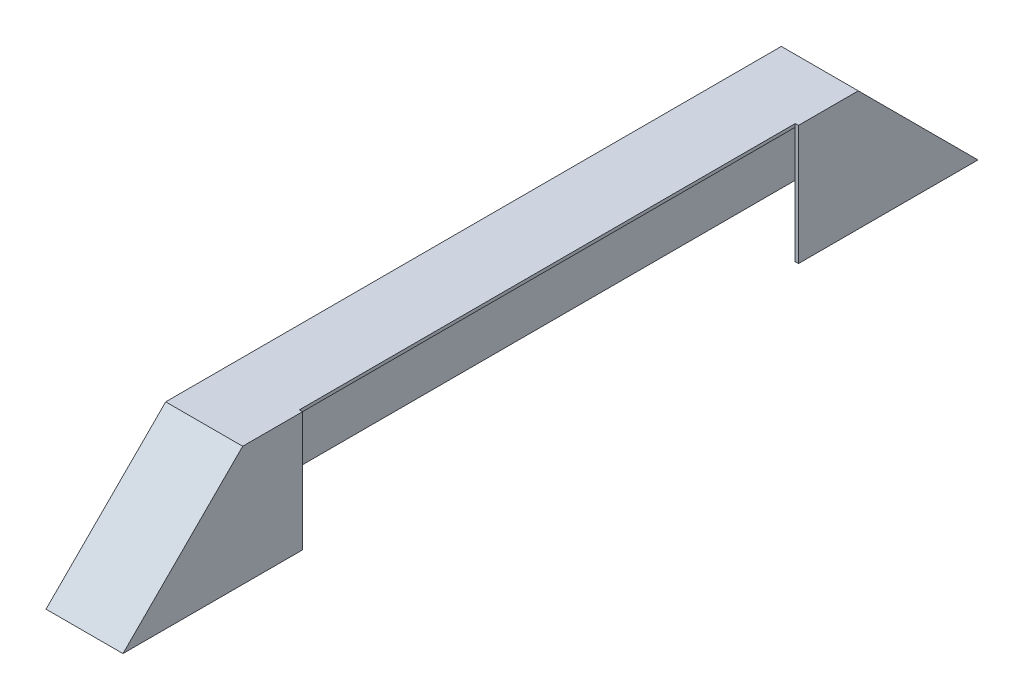
ISO-10303-21;
HEADER;
FILE_DESCRIPTION(('STEP AP214'),'2;1');
FILE_NAME('part.step','',(''),(''),'','','');
FILE_SCHEMA(('AUTOMOTIVE_DESIGN { 1 0 10303 214 1 1 1 1 }'));
ENDSEC;
DATA;
#1=APPLICATION_CONTEXT('core data for automotive mechanical design processes');
#2=APPLICATION_PROTOCOL_DEFINITION('international standard','automotive_design',2000,#1);
#3=PRODUCT_CONTEXT('',#1,'mechanical');
#4=PRODUCT('Part','Part','',(#3));
#5=PRODUCT_RELATED_PRODUCT_CATEGORY('part','',(#4));
#6=PRODUCT_DEFINITION_FORMATION('','',#4);
#7=PRODUCT_DEFINITION_CONTEXT('part definition',#1,'design');
#8=PRODUCT_DEFINITION('design','',#6,#7);
#9=PRODUCT_DEFINITION_SHAPE('','',#8);
#10=(LENGTH_UNIT() NAMED_UNIT(*) SI_UNIT(.MILLI.,.METRE.));
#11=(NAMED_UNIT(*) PLANE_ANGLE_UNIT() SI_UNIT($,.RADIAN.));
#12=(NAMED_UNIT(*) SI_UNIT($,.STERADIAN.) SOLID_ANGLE_UNIT());
#13=UNCERTAINTY_MEASURE_WITH_UNIT(LENGTH_MEASURE(1.E-05),#10,'distance_accuracy_value','');
#14=(GEOMETRIC_REPRESENTATION_CONTEXT(3) GLOBAL_UNCERTAINTY_ASSIGNED_CONTEXT((#13)) GLOBAL_UNIT_ASSIGNED_CONTEXT((#10,
#11,#12)) REPRESENTATION_CONTEXT('',''));
#15=CARTESIAN_POINT('',(0.,0.,0.));
#16=DIRECTION('',(0.,0.,1.));
#17=DIRECTION('',(1.,0.,0.));
#18=AXIS2_PLACEMENT_3D('',#15,#16,#17);
#19=CARTESIAN_POINT('',(114.3,0.,0.));
#20=DIRECTION('',(-1.,0.,0.));
#21=DIRECTION('',(0.,0.,1.));
#22=AXIS2_PLACEMENT_3D('',#19,#20,#21);
#23=PLANE('',#22);
#24=DIRECTION('',(0.,0.,-1.));
#25=VECTOR('',#24,1.);
#26=CARTESIAN_POINT('',(114.3,-88.9,634.999999999997));
#27=LINE('',#26,#25);
#28=CARTESIAN_POINT('',(114.3,-88.9,634.999999999997));
#29=VERTEX_POINT('',#28);
#30=CARTESIAN_POINT('',(114.3,-88.9,368.3));
#31=VERTEX_POINT('',#30);
#32=EDGE_CURVE('E200',#29,#31,#27,.T.);
#33=ORIENTED_EDGE('',*,*,#32,.T.);
#34=DIRECTION('',(0.,-1.,0.));
#35=VECTOR('',#34,1.);
#36=CARTESIAN_POINT('',(114.3,-88.9,368.3));
#37=LINE('',#36,#35);
#38=CARTESIAN_POINT('',(114.3,88.9,368.3));
#39=VERTEX_POINT('',#38);
#40=EDGE_CURVE('E143',#39,#31,#37,.T.);
#41=ORIENTED_EDGE('',*,*,#40,.F.);
#42=DIRECTION('',(0.,0.,1.));
#43=VECTOR('',#42,1.);
#44=CARTESIAN_POINT('',(114.3,88.9,457.2));
#45=LINE('',#44,#43);
#46=CARTESIAN_POINT('',(114.3,88.9,457.2));
#47=VERTEX_POINT('',#46);
#48=EDGE_CURVE('E148',#39,#47,#45,.T.);
#49=ORIENTED_EDGE('',*,*,#48,.T.);
#50=DIRECTION('',(0.,-0.707106781186554,0.707106781186541));
#51=VECTOR('',#50,1.);
#52=CARTESIAN_POINT('',(114.3,88.9,457.2));
#53=LINE('',#52,#51);
#54=EDGE_CURVE('E197',#47,#29,#53,.T.);
#55=ORIENTED_EDGE('',*,*,#54,.T.);
#56=EDGE_LOOP('',(#33,#41,#49,#55));
#57=FACE_BOUND('',#56,.T.);
#58=ADVANCED_FACE('F33',(#57),#23,.F.);
#59=CARTESIAN_POINT('',(109.5375,0.,0.));
#60=DIRECTION('',(-1.,0.,0.));
#61=DIRECTION('',(0.,0.,1.));
#62=AXIS2_PLACEMENT_3D('',#59,#60,#61);
#63=PLANE('',#62);
#64=DIRECTION('',(0.,1.,0.));
#65=VECTOR('',#64,1.);
#66=CARTESIAN_POINT('',(109.5375,0.,368.3));
#67=LINE('',#66,#65);
#68=CARTESIAN_POINT('',(109.5375,-88.9,368.3));
#69=VERTEX_POINT('',#68);
#70=CARTESIAN_POINT('',(109.5375,84.1375,368.3));
#71=VERTEX_POINT('',#70);
#72=EDGE_CURVE('E11',#69,#71,#67,.T.);
#73=ORIENTED_EDGE('',*,*,#72,.F.);
#74=DIRECTION('',(0.,0.,-1.));
#75=VECTOR('',#74,1.);
#76=CARTESIAN_POINT('',(109.5375,-88.9,0.));
#77=LINE('',#76,#75);
#78=CARTESIAN_POINT('',(109.5375,-88.9,628.264807909195));
#79=VERTEX_POINT('',#78);
#80=EDGE_CURVE('E56',#79,#69,#77,.T.);
#81=ORIENTED_EDGE('',*,*,#80,.F.);
#82=DIRECTION('',(0.,-0.707106781186554,0.707106781186541));
#83=VECTOR('',#82,1.);
#84=CARTESIAN_POINT('',(109.5375,269.682403954598,269.682403954603));
#85=LINE('',#84,#83);
#86=CARTESIAN_POINT('',(109.5375,84.1375,455.227307909198));
#87=VERTEX_POINT('',#86);
#88=EDGE_CURVE('E178',#87,#79,#85,.T.);
#89=ORIENTED_EDGE('',*,*,#88,.F.);
#90=DIRECTION('',(0.,0.,1.));
#91=VECTOR('',#90,1.);
#92=CARTESIAN_POINT('',(109.5375,84.1375,0.));
#93=LINE('',#92,#91);
#94=EDGE_CURVE('E168',#71,#87,#93,.T.);
#95=ORIENTED_EDGE('',*,*,#94,.F.);
#96=EDGE_LOOP('',(#73,#81,#89,#95));
#97=FACE_BOUND('',#96,.T.);
#98=ADVANCED_FACE('F261',(#97),#63,.T.);
#99=CARTESIAN_POINT('',(114.3,-88.9,-457.2));
#100=DIRECTION('',(0.,1.,0.));
#101=DIRECTION('',(0.,0.,1.));
#102=AXIS2_PLACEMENT_3D('',#99,#100,#101);
#103=PLANE('',#102);
#104=ORIENTED_EDGE('',*,*,#80,.T.);
#105=DIRECTION('',(1.,0.,0.));
#106=VECTOR('',#105,1.);
#107=CARTESIAN_POINT('',(-648.217341620956,-88.9,368.3));
#108=LINE('',#107,#106);
#109=EDGE_CURVE('E136',#69,#31,#108,.T.);
#110=ORIENTED_EDGE('',*,*,#109,.T.);
#111=ORIENTED_EDGE('',*,*,#32,.F.);
#112=DIRECTION('',(-1.,0.,0.));
#113=VECTOR('',#112,1.);
#114=CARTESIAN_POINT('',(114.3,-88.9,634.999999999997));
#115=LINE('',#114,#113);
#116=CARTESIAN_POINT('',(0.,-88.9,634.999999999997));
#117=VERTEX_POINT('',#116);
#118=EDGE_CURVE('E214',#29,#117,#115,.T.);
#119=ORIENTED_EDGE('',*,*,#118,.T.);
#120=DIRECTION('',(0.,0.,-1.));
#121=VECTOR('',#120,1.);
#122=CARTESIAN_POINT('',(0.,-88.9,-457.2));
#123=LINE('',#122,#121);
#124=CARTESIAN_POINT('',(0.,-88.9,-635.000000000003));
#125=VERTEX_POINT('',#124);
#126=EDGE_CURVE('E193',#117,#125,#123,.T.);
#127=ORIENTED_EDGE('',*,*,#126,.T.);
#128=DIRECTION('',(-1.,0.,0.));
#129=VECTOR('',#128,1.);
#130=CARTESIAN_POINT('',(114.3,-88.9,-635.000000000003));
#131=LINE('',#130,#129);
#132=CARTESIAN_POINT('',(114.3,-88.9,-635.000000000003));
#133=VERTEX_POINT('',#132);
#134=EDGE_CURVE('E203',#133,#125,#131,.T.);
#135=ORIENTED_EDGE('',*,*,#134,.F.);
#136=CARTESIAN_POINT('',(114.3,-88.9,-368.3));
#137=VERTEX_POINT('',#136);
#138=EDGE_CURVE('E199',#137,#133,#27,.T.);
#139=ORIENTED_EDGE('',*,*,#138,.F.);
#140=DIRECTION('',(1.,0.,0.));
#141=VECTOR('',#140,1.);
#142=CARTESIAN_POINT('',(-648.217341620956,-88.9,-368.3));
#143=LINE('',#142,#141);
#144=CARTESIAN_POINT('',(109.5375,-88.9,-368.3));
#145=VERTEX_POINT('',#144);
#146=EDGE_CURVE('E242',#145,#137,#143,.T.);
#147=ORIENTED_EDGE('',*,*,#146,.F.);
#148=CARTESIAN_POINT('',(109.5375,-88.9,-628.264807909201));
#149=VERTEX_POINT('',#148);
#150=EDGE_CURVE('E182',#145,#149,#77,.T.);
#151=ORIENTED_EDGE('',*,*,#150,.T.);
#152=DIRECTION('',(-1.,0.,0.));
#153=VECTOR('',#152,1.);
#154=CARTESIAN_POINT('',(114.3,-88.9,-628.264807909201));
#155=LINE('',#154,#153);
#156=CARTESIAN_POINT('',(4.7625,-88.9,-628.264807909201));
#157=VERTEX_POINT('',#156);
#158=EDGE_CURVE('E183',#149,#157,#155,.T.);
#159=ORIENTED_EDGE('',*,*,#158,.T.);
#160=DIRECTION('',(0.,0.,-1.));
#161=VECTOR('',#160,1.);
#162=CARTESIAN_POINT('',(4.7625,-88.9,0.));
#163=LINE('',#162,#161);
#164=CARTESIAN_POINT('',(4.7625,-88.9,628.264807909195));
#165=VERTEX_POINT('',#164);
#166=EDGE_CURVE('E169',#165,#157,#163,.T.);
#167=ORIENTED_EDGE('',*,*,#166,.F.);
#168=DIRECTION('',(-1.,0.,0.));
#169=VECTOR('',#168,1.);
#170=CARTESIAN_POINT('',(114.3,-88.9,628.264807909195));
#171=LINE('',#170,#169);
#172=EDGE_CURVE('E174',#79,#165,#171,.T.);
#173=ORIENTED_EDGE('',*,*,#172,.F.);
#174=EDGE_LOOP('',(#104,#110,#111,#119,#127,#135,#139,#147,#151,#159,#167,#173));
#175=FACE_BOUND('',#174,.T.);
#176=ADVANCED_FACE('F234',(#175),#103,.F.);
#177=CARTESIAN_POINT('',(114.3,88.9,-457.2));
#178=DIRECTION('',(0.,-0.707106781186554,0.707106781186541));
#179=DIRECTION('',(0.,-0.707106781186541,-0.707106781186554));
#180=AXIS2_PLACEMENT_3D('',#177,#178,#179);
#181=PLANE('',#180);
#182=DIRECTION('',(0.,0.707106781186541,0.707106781186554));
#183=VECTOR('',#182,1.);
#184=CARTESIAN_POINT('',(0.,88.9,-457.2));
#185=LINE('',#184,#183);
#186=CARTESIAN_POINT('',(0.,88.9,-457.2));
#187=VERTEX_POINT('',#186);
#188=EDGE_CURVE('E163',#125,#187,#185,.T.);
#189=ORIENTED_EDGE('',*,*,#188,.T.);
#190=DIRECTION('',(-1.,0.,0.));
#191=VECTOR('',#190,1.);
#192=CARTESIAN_POINT('',(114.3,88.9,-457.2));
#193=LINE('',#192,#191);
#194=CARTESIAN_POINT('',(114.3,88.9,-457.2));
#195=VERTEX_POINT('',#194);
#196=EDGE_CURVE('E41',#195,#187,#193,.T.);
#197=ORIENTED_EDGE('',*,*,#196,.F.);
#198=DIRECTION('',(0.,0.707106781186541,0.707106781186554));
#199=VECTOR('',#198,1.);
#200=CARTESIAN_POINT('',(114.3,88.9,-457.2));
#201=LINE('',#200,#199);
#202=EDGE_CURVE('E190',#133,#195,#201,.T.);
#203=ORIENTED_EDGE('',*,*,#202,.F.);
#204=ORIENTED_EDGE('',*,*,#134,.T.);
#205=EDGE_LOOP('',(#189,#197,#203,#204));
#206=FACE_BOUND('',#205,.T.);
#207=ADVANCED_FACE('F35',(#206),#181,.F.);
#208=CARTESIAN_POINT('',(114.3,88.9,457.2));
#209=DIRECTION('',(0.,-1.,0.));
#210=DIRECTION('',(0.,0.,-1.));
#211=AXIS2_PLACEMENT_3D('',#208,#209,#210);
#212=PLANE('',#211);
#213=ORIENTED_EDGE('',*,*,#48,.F.);
#214=DIRECTION('',(1.,0.,0.));
#215=VECTOR('',#214,1.);
#216=CARTESIAN_POINT('',(-648.217341620956,88.9,368.3));
#217=LINE('',#216,#215);
#218=CARTESIAN_POINT('',(109.5375,88.9,368.3));
#219=VERTEX_POINT('',#218);
#220=EDGE_CURVE('E132',#219,#39,#217,.T.);
#221=ORIENTED_EDGE('',*,*,#220,.F.);
#222=DIRECTION('',(0.,0.,1.));
#223=VECTOR('',#222,1.);
#224=CARTESIAN_POINT('',(109.5375,88.9,368.3));
#225=LINE('',#224,#223);
#226=CARTESIAN_POINT('',(109.5375,88.9,-368.3));
#227=VERTEX_POINT('',#226);
#228=EDGE_CURVE('E139',#227,#219,#225,.T.);
#229=ORIENTED_EDGE('',*,*,#228,.F.);
#230=DIRECTION('',(1.,0.,0.));
#231=VECTOR('',#230,1.);
#232=CARTESIAN_POINT('',(-648.217341620956,88.9,-368.3));
#233=LINE('',#232,#231);
#234=CARTESIAN_POINT('',(114.3,88.9,-368.3));
#235=VERTEX_POINT('',#234);
#236=EDGE_CURVE('E153',#227,#235,#233,.T.);
#237=ORIENTED_EDGE('',*,*,#236,.T.);
#238=EDGE_CURVE('E194',#195,#235,#45,.T.);
#239=ORIENTED_EDGE('',*,*,#238,.F.);
#240=ORIENTED_EDGE('',*,*,#196,.T.);
#241=DIRECTION('',(0.,0.,1.));
#242=VECTOR('',#241,1.);
#243=CARTESIAN_POINT('',(0.,88.9,457.2));
#244=LINE('',#243,#242);
#245=CARTESIAN_POINT('',(0.,88.9,457.2));
#246=VERTEX_POINT('',#245);
#247=EDGE_CURVE('E206',#187,#246,#244,.T.);
#248=ORIENTED_EDGE('',*,*,#247,.T.);
#249=DIRECTION('',(-1.,0.,0.));
#250=VECTOR('',#249,1.);
#251=CARTESIAN_POINT('',(114.3,88.9,457.2));
#252=LINE('',#251,#250);
#253=EDGE_CURVE('E217',#47,#246,#252,.T.);
#254=ORIENTED_EDGE('',*,*,#253,.F.);
#255=EDGE_LOOP('',(#213,#221,#229,#237,#239,#240,#248,#254));
#256=FACE_BOUND('',#255,.T.);
#257=ADVANCED_FACE('F146',(#256),#212,.F.);
#258=CARTESIAN_POINT('',(114.3,88.9,457.2));
#259=DIRECTION('',(0.,-0.707106781186541,-0.707106781186554));
#260=DIRECTION('',(0.,0.707106781186554,-0.707106781186541));
#261=AXIS2_PLACEMENT_3D('',#258,#259,#260);
#262=PLANE('',#261);
#263=DIRECTION('',(0.,-0.707106781186554,0.707106781186541));
#264=VECTOR('',#263,1.);
#265=CARTESIAN_POINT('',(0.,88.9,457.2));
#266=LINE('',#265,#264);
#267=EDGE_CURVE('E208',#246,#117,#266,.T.);
#268=ORIENTED_EDGE('',*,*,#267,.T.);
#269=ORIENTED_EDGE('',*,*,#118,.F.);
#270=ORIENTED_EDGE('',*,*,#54,.F.);
#271=ORIENTED_EDGE('',*,*,#253,.T.);
#272=EDGE_LOOP('',(#268,#269,#270,#271));
#273=FACE_BOUND('',#272,.T.);
#274=ADVANCED_FACE('F230',(#273),#262,.F.);
#275=ORIENTED_EDGE('',*,*,#238,.T.);
#276=DIRECTION('',(0.,1.,0.));
#277=VECTOR('',#276,1.);
#278=CARTESIAN_POINT('',(114.3,-88.9,-368.3));
#279=LINE('',#278,#277);
#280=EDGE_CURVE('E237',#137,#235,#279,.T.);
#281=ORIENTED_EDGE('',*,*,#280,.F.);
#282=ORIENTED_EDGE('',*,*,#138,.T.);
#283=ORIENTED_EDGE('',*,*,#202,.T.);
#284=EDGE_LOOP('',(#275,#281,#282,#283));
#285=FACE_BOUND('',#284,.T.);
#286=ADVANCED_FACE('F249',(#285),#23,.F.);
#287=CARTESIAN_POINT('',(0.,0.,0.));
#288=DIRECTION('',(-1.,0.,0.));
#289=DIRECTION('',(0.,0.,1.));
#290=AXIS2_PLACEMENT_3D('',#287,#288,#289);
#291=PLANE('',#290);
#292=ORIENTED_EDGE('',*,*,#188,.F.);
#293=ORIENTED_EDGE('',*,*,#126,.F.);
#294=ORIENTED_EDGE('',*,*,#267,.F.);
#295=ORIENTED_EDGE('',*,*,#247,.F.);
#296=EDGE_LOOP('',(#292,#293,#294,#295));
#297=FACE_BOUND('',#296,.T.);
#298=ADVANCED_FACE('F226',(#297),#291,.T.);
#299=CARTESIAN_POINT('',(114.3,85.532403954599,-453.832403954599));
#300=DIRECTION('',(0.,-0.707106781186554,0.707106781186541));
#301=DIRECTION('',(0.,-0.707106781186541,-0.707106781186554));
#302=AXIS2_PLACEMENT_3D('',#299,#300,#301);
#303=PLANE('',#302);
#304=DIRECTION('',(0.,0.707106781186541,0.707106781186554));
#305=VECTOR('',#304,1.);
#306=CARTESIAN_POINT('',(4.7625,269.6824039546,-269.682403954595));
#307=LINE('',#306,#305);
#308=CARTESIAN_POINT('',(4.7625,84.1375,-455.227307909198));
#309=VERTEX_POINT('',#308);
#310=EDGE_CURVE('E155',#157,#309,#307,.T.);
#311=ORIENTED_EDGE('',*,*,#310,.F.);
#312=ORIENTED_EDGE('',*,*,#158,.F.);
#313=DIRECTION('',(0.,0.707106781186541,0.707106781186554));
#314=VECTOR('',#313,1.);
#315=CARTESIAN_POINT('',(109.5375,269.6824039546,-269.682403954595));
#316=LINE('',#315,#314);
#317=CARTESIAN_POINT('',(109.5375,84.1375,-455.227307909198));
#318=VERTEX_POINT('',#317);
#319=EDGE_CURVE('E165',#149,#318,#316,.T.);
#320=ORIENTED_EDGE('',*,*,#319,.T.);
#321=DIRECTION('',(-1.,0.,0.));
#322=VECTOR('',#321,1.);
#323=CARTESIAN_POINT('',(114.3,84.1375,-455.227307909198));
#324=LINE('',#323,#322);
#325=EDGE_CURVE('E160',#318,#309,#324,.T.);
#326=ORIENTED_EDGE('',*,*,#325,.T.);
#327=EDGE_LOOP('',(#311,#312,#320,#326));
#328=FACE_BOUND('',#327,.T.);
#329=ADVANCED_FACE('F256',(#328),#303,.T.);
#330=CARTESIAN_POINT('',(114.3,84.1375,457.2));
#331=DIRECTION('',(0.,-1.,0.));
#332=DIRECTION('',(0.,0.,-1.));
#333=AXIS2_PLACEMENT_3D('',#330,#331,#332);
#334=PLANE('',#333);
#335=DIRECTION('',(0.,0.,1.));
#336=VECTOR('',#335,1.);
#337=CARTESIAN_POINT('',(4.7625,84.1375,0.));
#338=LINE('',#337,#336);
#339=CARTESIAN_POINT('',(4.7625,84.1375,455.227307909198));
#340=VERTEX_POINT('',#339);
#341=EDGE_CURVE('E159',#309,#340,#338,.T.);
#342=ORIENTED_EDGE('',*,*,#341,.F.);
#343=ORIENTED_EDGE('',*,*,#325,.F.);
#344=CARTESIAN_POINT('',(109.5375,84.1375,-368.3));
#345=VERTEX_POINT('',#344);
#346=EDGE_CURVE('E175',#318,#345,#93,.T.);
#347=ORIENTED_EDGE('',*,*,#346,.T.);
#348=EDGE_CURVE('E179',#345,#71,#93,.T.);
#349=ORIENTED_EDGE('',*,*,#348,.T.);
#350=ORIENTED_EDGE('',*,*,#94,.T.);
#351=DIRECTION('',(-1.,0.,0.));
#352=VECTOR('',#351,1.);
#353=CARTESIAN_POINT('',(114.3,84.1375,455.227307909198));
#354=LINE('',#353,#352);
#355=EDGE_CURVE('E164',#87,#340,#354,.T.);
#356=ORIENTED_EDGE('',*,*,#355,.T.);
#357=EDGE_LOOP('',(#342,#343,#347,#349,#350,#356));
#358=FACE_BOUND('',#357,.T.);
#359=ADVANCED_FACE('F281',(#358),#334,.T.);
#360=CARTESIAN_POINT('',(114.3,85.5324039545991,453.832403954599));
#361=DIRECTION('',(0.,-0.707106781186541,-0.707106781186554));
#362=DIRECTION('',(0.,0.707106781186554,-0.707106781186541));
#363=AXIS2_PLACEMENT_3D('',#360,#361,#362);
#364=PLANE('',#363);
#365=DIRECTION('',(0.,-0.707106781186554,0.707106781186541));
#366=VECTOR('',#365,1.);
#367=CARTESIAN_POINT('',(4.7625,269.682403954598,269.682403954603));
#368=LINE('',#367,#366);
#369=EDGE_CURVE('E171',#340,#165,#368,.T.);
#370=ORIENTED_EDGE('',*,*,#369,.F.);
#371=ORIENTED_EDGE('',*,*,#355,.F.);
#372=ORIENTED_EDGE('',*,*,#88,.T.);
#373=ORIENTED_EDGE('',*,*,#172,.T.);
#374=EDGE_LOOP('',(#370,#371,#372,#373));
#375=FACE_BOUND('',#374,.T.);
#376=ADVANCED_FACE('F274',(#375),#364,.T.);
#377=DIRECTION('',(0.,1.,0.));
#378=VECTOR('',#377,1.);
#379=CARTESIAN_POINT('',(109.5375,-88.9,-368.3));
#380=LINE('',#379,#378);
#381=EDGE_CURVE('E156',#145,#345,#380,.T.);
#382=ORIENTED_EDGE('',*,*,#381,.T.);
#383=ORIENTED_EDGE('',*,*,#346,.F.);
#384=ORIENTED_EDGE('',*,*,#319,.F.);
#385=ORIENTED_EDGE('',*,*,#150,.F.);
#386=EDGE_LOOP('',(#382,#383,#384,#385));
#387=FACE_BOUND('',#386,.T.);
#388=ADVANCED_FACE('F266',(#387),#63,.T.);
#389=CARTESIAN_POINT('',(4.7625,0.,0.));
#390=DIRECTION('',(-1.,0.,0.));
#391=DIRECTION('',(0.,0.,1.));
#392=AXIS2_PLACEMENT_3D('',#389,#390,#391);
#393=PLANE('',#392);
#394=ORIENTED_EDGE('',*,*,#310,.T.);
#395=ORIENTED_EDGE('',*,*,#341,.T.);
#396=ORIENTED_EDGE('',*,*,#369,.T.);
#397=ORIENTED_EDGE('',*,*,#166,.T.);
#398=EDGE_LOOP('',(#394,#395,#396,#397));
#399=FACE_BOUND('',#398,.T.);
#400=ADVANCED_FACE('F273',(#399),#393,.F.);
#401=CARTESIAN_POINT('',(109.5375,0.,0.));
#402=DIRECTION('',(-1.,0.,0.));
#403=DIRECTION('',(0.,0.,1.));
#404=AXIS2_PLACEMENT_3D('',#401,#402,#403);
#405=PLANE('',#404);
#406=ORIENTED_EDGE('',*,*,#348,.F.);
#407=EDGE_CURVE('E48',#345,#227,#380,.T.);
#408=ORIENTED_EDGE('',*,*,#407,.T.);
#409=ORIENTED_EDGE('',*,*,#228,.T.);
#410=DIRECTION('',(0.,-1.,0.));
#411=VECTOR('',#410,1.);
#412=CARTESIAN_POINT('',(109.5375,-88.9,368.3));
#413=LINE('',#412,#411);
#414=EDGE_CURVE('E128',#219,#71,#413,.T.);
#415=ORIENTED_EDGE('',*,*,#414,.T.);
#416=EDGE_LOOP('',(#406,#408,#409,#415));
#417=FACE_BOUND('',#416,.T.);
#418=ADVANCED_FACE('F140',(#417),#405,.F.);
#419=CARTESIAN_POINT('',(-648.217341620956,-88.9,368.3));
#420=DIRECTION('',(0.,0.,1.));
#421=DIRECTION('',(1.,0.,0.));
#422=AXIS2_PLACEMENT_3D('',#419,#420,#421);
#423=PLANE('',#422);
#424=ORIENTED_EDGE('',*,*,#220,.T.);
#425=ORIENTED_EDGE('',*,*,#40,.T.);
#426=ORIENTED_EDGE('',*,*,#109,.F.);
#427=ORIENTED_EDGE('',*,*,#72,.T.);
#428=ORIENTED_EDGE('',*,*,#414,.F.);
#429=EDGE_LOOP('',(#424,#425,#426,#427,#428));
#430=FACE_BOUND('',#429,.T.);
#431=ADVANCED_FACE('F130',(#430),#423,.F.);
#432=CARTESIAN_POINT('',(-648.217341620956,-88.9,-368.3));
#433=DIRECTION('',(0.,0.,-1.));
#434=DIRECTION('',(-1.,0.,0.));
#435=AXIS2_PLACEMENT_3D('',#432,#433,#434);
#436=PLANE('',#435);
#437=ORIENTED_EDGE('',*,*,#146,.T.);
#438=ORIENTED_EDGE('',*,*,#280,.T.);
#439=ORIENTED_EDGE('',*,*,#236,.F.);
#440=ORIENTED_EDGE('',*,*,#407,.F.);
#441=ORIENTED_EDGE('',*,*,#381,.F.);
#442=EDGE_LOOP('',(#437,#438,#439,#440,#441));
#443=FACE_BOUND('',#442,.T.);
#444=ADVANCED_FACE('F245',(#443),#436,.F.);
#445=CLOSED_SHELL('',(#58,#98,#176,#207,#257,#274,#286,#298,#329,#359,#376,#388,#400,#418,#431,#444));
#446=MANIFOLD_SOLID_BREP('B2',#445);
#447=ADVANCED_BREP_SHAPE_REPRESENTATION('',(#18,#446),#14);
#448=SHAPE_DEFINITION_REPRESENTATION(#9,#447);
ENDSEC;
END-ISO-10303-21;
